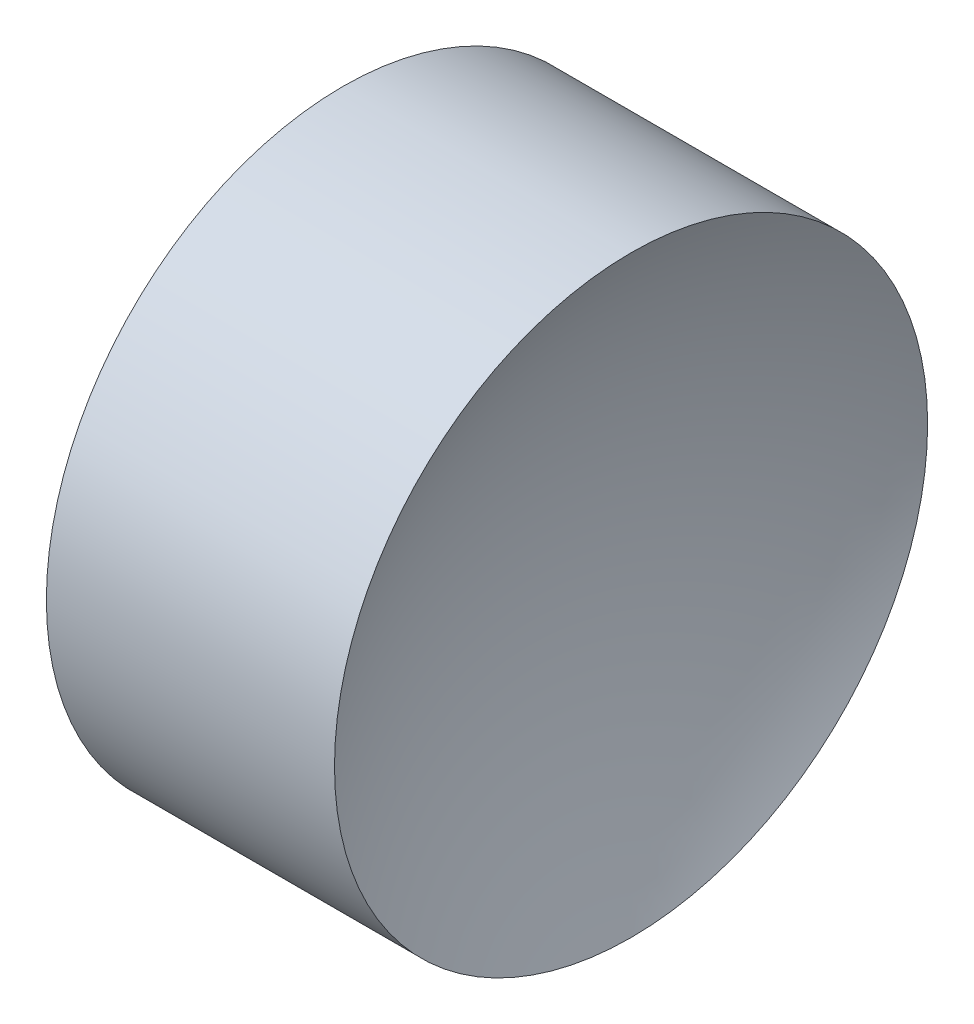
ISO-10303-21;
HEADER;
FILE_DESCRIPTION(('STEP AP214'),'2;1');
FILE_NAME('part.step','',(''),(''),'','','');
FILE_SCHEMA(('AUTOMOTIVE_DESIGN { 1 0 10303 214 1 1 1 1 }'));
ENDSEC;
DATA;
#1=APPLICATION_CONTEXT('core data for automotive mechanical design processes');
#2=APPLICATION_PROTOCOL_DEFINITION('international standard','automotive_design',2000,#1);
#3=PRODUCT_CONTEXT('',#1,'mechanical');
#4=PRODUCT('Part','Part','',(#3));
#5=PRODUCT_RELATED_PRODUCT_CATEGORY('part','',(#4));
#6=PRODUCT_DEFINITION_FORMATION('','',#4);
#7=PRODUCT_DEFINITION_CONTEXT('part definition',#1,'design');
#8=PRODUCT_DEFINITION('design','',#6,#7);
#9=PRODUCT_DEFINITION_SHAPE('','',#8);
#10=(LENGTH_UNIT() NAMED_UNIT(*) SI_UNIT(.MILLI.,.METRE.));
#11=(NAMED_UNIT(*) PLANE_ANGLE_UNIT() SI_UNIT($,.RADIAN.));
#12=(NAMED_UNIT(*) SI_UNIT($,.STERADIAN.) SOLID_ANGLE_UNIT());
#13=UNCERTAINTY_MEASURE_WITH_UNIT(LENGTH_MEASURE(1.E-05),#10,'distance_accuracy_value','');
#14=(GEOMETRIC_REPRESENTATION_CONTEXT(3) GLOBAL_UNCERTAINTY_ASSIGNED_CONTEXT((#13)) GLOBAL_UNIT_ASSIGNED_CONTEXT((#10,
#11,#12)) REPRESENTATION_CONTEXT('',''));
#15=CARTESIAN_POINT('',(0.,0.,0.));
#16=DIRECTION('',(0.,0.,1.));
#17=DIRECTION('',(1.,0.,0.));
#18=AXIS2_PLACEMENT_3D('',#15,#16,#17);
#19=CARTESIAN_POINT('',(16.5118528717462,13.0445205745975,0.));
#20=DIRECTION('',(-1.,0.,0.));
#21=DIRECTION('',(0.,1.,0.));
#22=AXIS2_PLACEMENT_3D('',#19,#20,#21);
#23=SPHERICAL_SURFACE('',#22,6.75);
#24=CARTESIAN_POINT('',(22.4817774943859,13.0445205745975,0.));
#25=DIRECTION('',(-1.,0.,0.));
#26=DIRECTION('',(0.,0.,1.));
#27=AXIS2_PLACEMENT_3D('',#24,#25,#26);
#28=CIRCLE('',#27,3.15);
#29=CARTESIAN_POINT('',(22.4817774943859,13.0445205745975,3.15));
#30=VERTEX_POINT('',#29);
#31=EDGE_CURVE('E41',#30,#30,#28,.T.);
#32=ORIENTED_EDGE('',*,*,#31,.T.);
#33=EDGE_LOOP('',(#32));
#34=FACE_BOUND('',#33,.T.);
#35=ADVANCED_FACE('F35',(#34),#23,.F.);
#36=CARTESIAN_POINT('',(31.5118528717462,13.0445205745975,0.));
#37=DIRECTION('',(-1.,0.,0.));
#38=DIRECTION('',(0.,1.,0.));
#39=AXIS2_PLACEMENT_3D('',#36,#37,#38);
#40=SPHERICAL_SURFACE('',#39,6.75);
#41=CARTESIAN_POINT('',(25.5419282491065,13.0445205745975,0.));
#42=DIRECTION('',(-1.,0.,0.));
#43=DIRECTION('',(0.,0.,1.));
#44=AXIS2_PLACEMENT_3D('',#41,#42,#43);
#45=CIRCLE('',#44,3.15);
#46=CARTESIAN_POINT('',(25.5419282491065,13.0445205745975,3.15));
#47=VERTEX_POINT('',#46);
#48=EDGE_CURVE('E10',#47,#47,#45,.T.);
#49=ORIENTED_EDGE('',*,*,#48,.F.);
#50=EDGE_LOOP('',(#49));
#51=FACE_BOUND('',#50,.T.);
#52=ADVANCED_FACE('F50',(#51),#40,.F.);
#53=CARTESIAN_POINT('',(21.2249305570684,13.0445205745975,0.));
#54=DIRECTION('',(-1.,0.,0.));
#55=DIRECTION('',(0.,0.,1.));
#56=AXIS2_PLACEMENT_3D('',#53,#54,#55);
#57=CYLINDRICAL_SURFACE('',#56,3.15);
#58=ORIENTED_EDGE('',*,*,#31,.F.);
#59=EDGE_LOOP('',(#58));
#60=FACE_BOUND('',#59,.T.);
#61=ORIENTED_EDGE('',*,*,#48,.T.);
#62=EDGE_LOOP('',(#61));
#63=FACE_BOUND('',#62,.T.);
#64=ADVANCED_FACE('F48',(#60,#63),#57,.T.);
#65=CLOSED_SHELL('',(#35,#52,#64));
#66=MANIFOLD_SOLID_BREP('B2',#65);
#67=ADVANCED_BREP_SHAPE_REPRESENTATION('',(#18,#66),#14);
#68=SHAPE_DEFINITION_REPRESENTATION(#9,#67);
ENDSEC;
END-ISO-10303-21;
